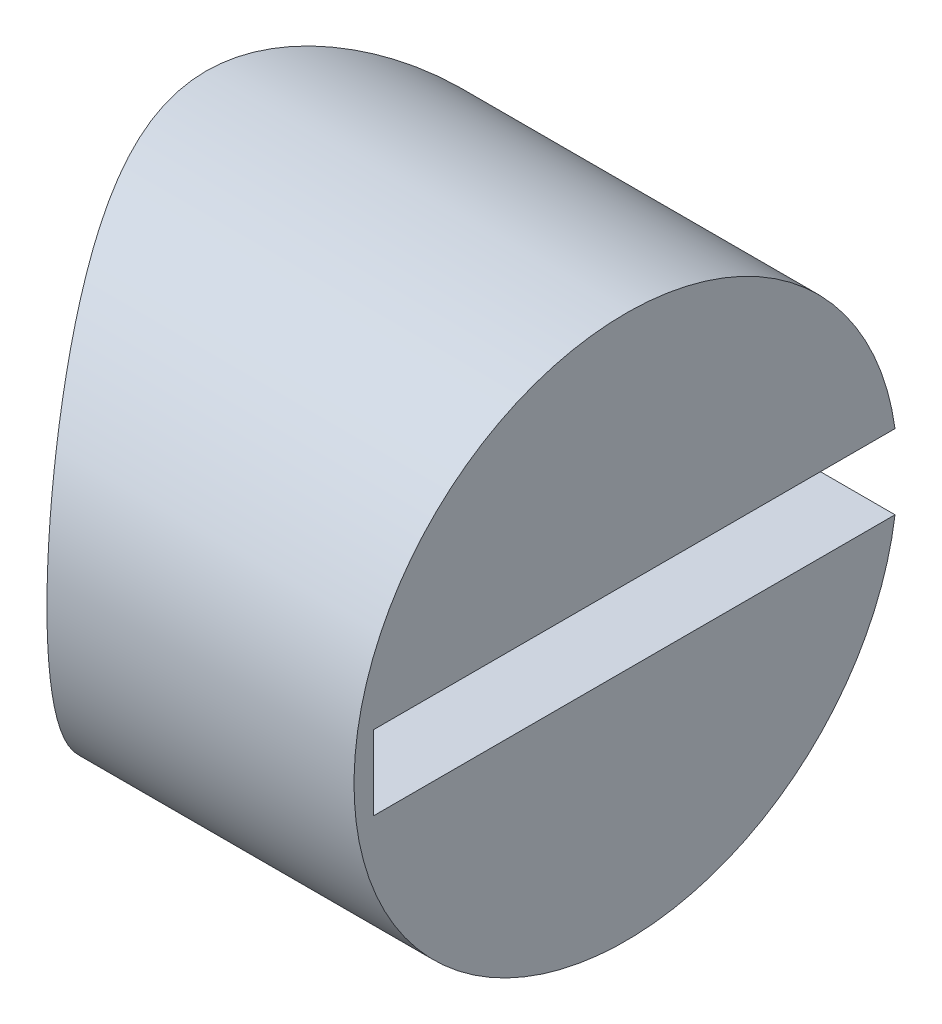
ISO-10303-21;
HEADER;
FILE_DESCRIPTION(('STEP AP214'),'2;1');
FILE_NAME('part.step','',(''),(''),'','','');
FILE_SCHEMA(('AUTOMOTIVE_DESIGN { 1 0 10303 214 1 1 1 1 }'));
ENDSEC;
DATA;
#1=APPLICATION_CONTEXT('core data for automotive mechanical design processes');
#2=APPLICATION_PROTOCOL_DEFINITION('international standard','automotive_design',2000,#1);
#3=PRODUCT_CONTEXT('',#1,'mechanical');
#4=PRODUCT('Part','Part','',(#3));
#5=PRODUCT_RELATED_PRODUCT_CATEGORY('part','',(#4));
#6=PRODUCT_DEFINITION_FORMATION('','',#4);
#7=PRODUCT_DEFINITION_CONTEXT('part definition',#1,'design');
#8=PRODUCT_DEFINITION('design','',#6,#7);
#9=PRODUCT_DEFINITION_SHAPE('','',#8);
#10=(LENGTH_UNIT() NAMED_UNIT(*) SI_UNIT(.MILLI.,.METRE.));
#11=(NAMED_UNIT(*) PLANE_ANGLE_UNIT() SI_UNIT($,.RADIAN.));
#12=(NAMED_UNIT(*) SI_UNIT($,.STERADIAN.) SOLID_ANGLE_UNIT());
#13=UNCERTAINTY_MEASURE_WITH_UNIT(LENGTH_MEASURE(1.E-05),#10,'distance_accuracy_value','');
#14=(GEOMETRIC_REPRESENTATION_CONTEXT(3) GLOBAL_UNCERTAINTY_ASSIGNED_CONTEXT((#13)) GLOBAL_UNIT_ASSIGNED_CONTEXT((#10,
#11,#12)) REPRESENTATION_CONTEXT('',''));
#15=CARTESIAN_POINT('',(0.,0.,0.));
#16=DIRECTION('',(0.,0.,1.));
#17=DIRECTION('',(1.,0.,0.));
#18=AXIS2_PLACEMENT_3D('',#15,#16,#17);
#19=CARTESIAN_POINT('',(18.1165376918575,6.,2.20308013006969));
#20=DIRECTION('',(0.,0.,-1.));
#21=DIRECTION('',(-1.,0.,0.));
#22=AXIS2_PLACEMENT_3D('',#19,#20,#21);
#23=PLANE('',#22);
#24=DIRECTION('',(-1.,0.,0.));
#25=VECTOR('',#24,1.);
#26=CARTESIAN_POINT('',(18.1165376918575,3.32583707335798,2.20308013006969));
#27=LINE('',#26,#25);
#28=CARTESIAN_POINT('',(18.,3.32583707335798,2.20308013006969));
#29=VERTEX_POINT('',#28);
#30=CARTESIAN_POINT('',(17.1165376918575,3.32583707335798,2.20308013006969));
#31=VERTEX_POINT('',#30);
#32=EDGE_CURVE('E94',#29,#31,#27,.T.);
#33=ORIENTED_EDGE('',*,*,#32,.F.);
#34=DIRECTION('',(0.,-1.,0.));
#35=VECTOR('',#34,1.);
#36=CARTESIAN_POINT('',(18.,6.,2.20308013006969));
#37=LINE('',#36,#35);
#38=CARTESIAN_POINT('',(18.,2.67416292664202,2.20308013006969));
#39=VERTEX_POINT('',#38);
#40=EDGE_CURVE('E89',#29,#39,#37,.T.);
#41=ORIENTED_EDGE('',*,*,#40,.T.);
#42=DIRECTION('',(-1.,0.,0.));
#43=VECTOR('',#42,1.);
#44=CARTESIAN_POINT('',(18.1165376918575,2.67416292664202,2.20308013006969));
#45=LINE('',#44,#43);
#46=CARTESIAN_POINT('',(17.1165376918575,2.67416292664202,2.20308013006969));
#47=VERTEX_POINT('',#46);
#48=EDGE_CURVE('E83',#39,#47,#45,.T.);
#49=ORIENTED_EDGE('',*,*,#48,.T.);
#50=DIRECTION('',(0.,-1.,0.));
#51=VECTOR('',#50,1.);
#52=CARTESIAN_POINT('',(17.1165376918575,6.,2.20308013006969));
#53=LINE('',#52,#51);
#54=EDGE_CURVE('E88',#31,#47,#53,.T.);
#55=ORIENTED_EDGE('',*,*,#54,.F.);
#56=EDGE_LOOP('',(#33,#41,#49,#55));
#57=FACE_BOUND('',#56,.T.);
#58=ADVANCED_FACE('F46',(#57),#23,.T.);
#59=CARTESIAN_POINT('',(18.1165376918575,3.32583707335798,2.20308013006969));
#60=DIRECTION('',(0.,-1.,0.));
#61=DIRECTION('',(0.,0.,-1.));
#62=AXIS2_PLACEMENT_3D('',#59,#60,#61);
#63=PLANE('',#62);
#64=DIRECTION('',(-1.,0.,0.));
#65=VECTOR('',#64,1.);
#66=CARTESIAN_POINT('',(18.25,3.32583707335798,-2.35254228476886));
#67=LINE('',#66,#65);
#68=CARTESIAN_POINT('',(18.,3.32583707335798,-2.35254228476886));
#69=VERTEX_POINT('',#68);
#70=CARTESIAN_POINT('',(17.097735902548,3.32583707335798,-2.35254228476886));
#71=VERTEX_POINT('',#70);
#72=EDGE_CURVE('E109',#69,#71,#67,.T.);
#73=ORIENTED_EDGE('',*,*,#72,.F.);
#74=DIRECTION('',(0.,0.,1.));
#75=VECTOR('',#74,1.);
#76=CARTESIAN_POINT('',(18.,3.32583707335798,2.20308013006969));
#77=LINE('',#76,#75);
#78=EDGE_CURVE('E62',#69,#29,#77,.T.);
#79=ORIENTED_EDGE('',*,*,#78,.T.);
#80=ORIENTED_EDGE('',*,*,#32,.T.);
#81=CARTESIAN_POINT('',(-1.,3.32583707335798,0.));
#82=DIRECTION('',(0.,-1.,0.));
#83=DIRECTION('',(0.,0.,-1.));
#84=AXIS2_PLACEMENT_3D('',#81,#82,#83);
#85=CIRCLE('',#84,18.25);
#86=EDGE_CURVE('E105',#71,#31,#85,.T.);
#87=ORIENTED_EDGE('',*,*,#86,.F.);
#88=EDGE_LOOP('',(#73,#79,#80,#87));
#89=FACE_BOUND('',#88,.T.);
#90=ADVANCED_FACE('F138',(#89),#63,.T.);
#91=CARTESIAN_POINT('',(17.850655436183,2.67416292664202,-3.79691986993031));
#92=DIRECTION('',(0.,1.,0.));
#93=DIRECTION('',(0.,0.,1.));
#94=AXIS2_PLACEMENT_3D('',#91,#92,#93);
#95=PLANE('',#94);
#96=ORIENTED_EDGE('',*,*,#48,.F.);
#97=DIRECTION('',(0.,0.,-1.));
#98=VECTOR('',#97,1.);
#99=CARTESIAN_POINT('',(18.,2.67416292664202,-3.79691986993031));
#100=LINE('',#99,#98);
#101=CARTESIAN_POINT('',(18.,2.67416292664202,-2.35254228476886));
#102=VERTEX_POINT('',#101);
#103=EDGE_CURVE('E139',#39,#102,#100,.T.);
#104=ORIENTED_EDGE('',*,*,#103,.T.);
#105=DIRECTION('',(-1.,0.,0.));
#106=VECTOR('',#105,1.);
#107=CARTESIAN_POINT('',(18.25,2.67416292664202,-2.35254228476886));
#108=LINE('',#107,#106);
#109=CARTESIAN_POINT('',(17.097735902548,2.67416292664202,-2.35254228476886));
#110=VERTEX_POINT('',#109);
#111=EDGE_CURVE('E54',#110,#102,#108,.F.);
#112=ORIENTED_EDGE('',*,*,#111,.F.);
#113=CARTESIAN_POINT('',(-1.,2.67416292664202,0.));
#114=DIRECTION('',(0.,1.,0.));
#115=DIRECTION('',(0.,0.,1.));
#116=AXIS2_PLACEMENT_3D('',#113,#114,#115);
#117=CIRCLE('',#116,18.25);
#118=EDGE_CURVE('E99',#47,#110,#117,.T.);
#119=ORIENTED_EDGE('',*,*,#118,.F.);
#120=EDGE_LOOP('',(#96,#104,#112,#119));
#121=FACE_BOUND('',#120,.T.);
#122=ADVANCED_FACE('F104',(#121),#95,.T.);
#123=CARTESIAN_POINT('',(18.25,3.,0.));
#124=DIRECTION('',(-1.,0.,0.));
#125=DIRECTION('',(0.,0.,1.));
#126=AXIS2_PLACEMENT_3D('',#123,#124,#125);
#127=CYLINDRICAL_SURFACE('',#126,2.375);
#128=CARTESIAN_POINT('',(14.5699347590451,0.864400915161115,1.03915442937648));
#129=CARTESIAN_POINT('',(14.532261280967,0.821085344243296,0.95014131885175));
#130=CARTESIAN_POINT('',(14.4965986971376,0.782941626493204,0.857638030698953));
#131=CARTESIAN_POINT('',(14.4330334419647,0.718024609399077,0.665908862075629));
#132=CARTESIAN_POINT('',(14.405138589969,0.691262753364969,0.566676331671528));
#133=CARTESIAN_POINT('',(14.372361181637,0.660643376592978,0.413289968436924));
#134=CARTESIAN_POINT('',(14.3629142047324,0.651999100970354,0.36104039159496));
#135=CARTESIAN_POINT('',(14.3476827550688,0.638192659761498,0.255568361032294));
#136=CARTESIAN_POINT('',(14.341896217254,0.633028530724701,0.202346473315096));
#137=CARTESIAN_POINT('',(14.334355629438,0.626317619150242,0.0954808057151526));
#138=CARTESIAN_POINT('',(14.3325943422839,0.624764344432173,0.0418379572831925));
#139=CARTESIAN_POINT('',(14.3331912257397,0.625294051890574,-0.0653913185596071));
#140=CARTESIAN_POINT('',(14.3355490470313,0.627376725722688,-0.118977750369214));
#141=CARTESIAN_POINT('',(14.3473597328304,0.637899688746503,-0.263538236915222));
#142=CARTESIAN_POINT('',(14.3606677735403,0.649809701870783,-0.353979563481457));
#143=CARTESIAN_POINT('',(14.3967721434786,0.683378868754725,-0.531103072367871));
#144=CARTESIAN_POINT('',(14.4195881921789,0.705058291777705,-0.617777026227758));
#145=CARTESIAN_POINT('',(14.4847140812114,0.770182037299633,-0.828243906078563));
#146=CARTESIAN_POINT('',(14.531076913591,0.819088478480586,-0.949081059044288));
#147=CARTESIAN_POINT('',(14.6301404916669,0.934415653046942,-1.17924528382042));
#148=CARTESIAN_POINT('',(14.6828530191417,1.00086922583023,-1.28855023064129));
#149=CARTESIAN_POINT('',(14.7904252853703,1.15251575436336,-1.49821612701064));
#150=CARTESIAN_POINT('',(14.845301189767,1.23822235240744,-1.59819843489821));
#151=CARTESIAN_POINT('',(14.9507962706194,1.42623324343095,-1.78361226490229));
#152=CARTESIAN_POINT('',(15.0014207729419,1.52851628507317,-1.86906213418636));
#153=CARTESIAN_POINT('',(15.0895451373331,1.73681034798782,-2.01478491107707));
#154=CARTESIAN_POINT('',(15.1278681536618,1.84126882001129,-2.07676870978046));
#155=CARTESIAN_POINT('',(15.1954290885343,2.06087065449729,-2.18486023116763));
#156=CARTESIAN_POINT('',(15.2246700296445,2.17601044555295,-2.23097323629552));
#157=CARTESIAN_POINT('',(15.2720132450649,2.41494767188962,-2.30522575948593));
#158=CARTESIAN_POINT('',(15.2900509618142,2.53879078982524,-2.33326114159592));
#159=CARTESIAN_POINT('',(15.3131755271682,2.7905430807739,-2.36915387307792));
#160=CARTESIAN_POINT('',(15.3182693911003,2.91845001319657,-2.37702215266437));
#161=CARTESIAN_POINT('',(15.3152442498206,3.16058144617906,-2.37233771224985));
#162=CARTESIAN_POINT('',(15.3084225925404,3.27486812179561,-2.36179014043319));
#163=CARTESIAN_POINT('',(15.2845077088614,3.49966881888721,-2.32463627291773));
#164=CARTESIAN_POINT('',(15.2674144942333,3.61018284468533,-2.29802999562117));
#165=CARTESIAN_POINT('',(15.2241231438048,3.82458908771562,-2.23009649266413));
#166=CARTESIAN_POINT('',(15.1979290574355,3.92848422573113,-2.18877581396996));
#167=CARTESIAN_POINT('',(15.1380422071007,4.12770567738207,-2.09311431622953));
#168=CARTESIAN_POINT('',(15.1043483125926,4.22303069608843,-2.03877153409934));
#169=CARTESIAN_POINT('',(15.0271724922604,4.4140649220293,-1.91197251040366));
#170=CARTESIAN_POINT('',(14.9830146114674,4.50859892598914,-1.83816296224651));
#171=CARTESIAN_POINT('',(14.8904599780247,4.68455700998357,-1.67840571080163));
#172=CARTESIAN_POINT('',(14.8420573107896,4.76596233395187,-1.59244096532103));
#173=CARTESIAN_POINT('',(14.7362906705802,4.92706705362857,-1.39493398498447));
#174=CARTESIAN_POINT('',(14.6787480731653,5.0043418955299,-1.2815052249655));
#175=CARTESIAN_POINT('',(14.5687662791743,5.13907964795686,-1.04111354648144));
#176=CARTESIAN_POINT('',(14.5163219223789,5.196562743879,-0.914164591229076));
#177=CARTESIAN_POINT('',(14.4408971610357,5.27414528673798,-0.691275158897109));
#178=CARTESIAN_POINT('',(14.4138958418073,5.30032223489973,-0.598833069611235));
#179=CARTESIAN_POINT('',(14.3702604106574,5.34147630652131,-0.409237609711479));
#180=CARTESIAN_POINT('',(14.3535983310642,5.35648366590218,-0.312097721705367));
#181=CARTESIAN_POINT('',(14.3336778455717,5.37433093697124,-0.114391943558449));
#182=CARTESIAN_POINT('',(14.3305361874119,5.37706487737038,-0.0138037430375299));
#183=CARTESIAN_POINT('',(14.3387230539154,5.36979994736584,0.186356277285663));
#184=CARTESIAN_POINT('',(14.350065592067,5.35978874604121,0.28592701869276));
#185=CARTESIAN_POINT('',(14.3871416554862,5.32572741529966,0.49421876150183));
#186=CARTESIAN_POINT('',(14.4146337332955,5.29994197770674,0.602324705488238));
#187=CARTESIAN_POINT('',(14.4796446682214,5.23483958043799,0.811272310513198));
#188=CARTESIAN_POINT('',(14.5171912206062,5.19548515727066,0.912092914838497));
#189=CARTESIAN_POINT('',(14.6111111111592,5.08902879519458,1.13895147379224));
#190=CARTESIAN_POINT('',(14.6695350176429,5.01704067904901,1.26184312789269));
#191=CARTESIAN_POINT('',(14.7872489669118,4.85272587202875,1.49268166441829));
#192=CARTESIAN_POINT('',(14.8465393987305,4.76038976642585,1.60062159111589));
#193=CARTESIAN_POINT('',(14.9604932273682,4.55558097492609,1.80038396670941));
#194=CARTESIAN_POINT('',(15.0151202456053,4.44296812559281,1.89208480539059));
#195=CARTESIAN_POINT('',(15.1140800272601,4.19981075734631,2.05484059887084));
#196=CARTESIAN_POINT('',(15.1584334397332,4.06930306149038,2.12593704028961));
#197=CARTESIAN_POINT('',(15.2235921545213,3.82688014043573,2.22932026495844));
#198=CARTESIAN_POINT('',(15.2474937205316,3.71800975595542,2.26682512112449));
#199=CARTESIAN_POINT('',(15.2852677929013,3.49434228765776,2.32585411384418));
#200=CARTESIAN_POINT('',(15.2991462832497,3.37954878400693,2.3473877857416));
#201=CARTESIAN_POINT('',(15.3158885097712,3.14692933538127,2.37334530116474));
#202=CARTESIAN_POINT('',(15.3187236083703,3.02909630285407,2.37772466052393));
#203=CARTESIAN_POINT('',(15.3130832334657,2.79434901941658,2.3689929891393));
#204=CARTESIAN_POINT('',(15.3046069435966,2.67743483543401,2.35588069598819));
#205=CARTESIAN_POINT('',(15.2775573191581,2.4527950183092,2.31381112171444));
#206=CARTESIAN_POINT('',(15.2594126481329,2.34488920361448,2.28552621054468));
#207=CARTESIAN_POINT('',(15.2144995892072,2.13573051339254,2.2149163850566));
#208=CARTESIAN_POINT('',(15.1877311934035,2.03447764396263,2.17259145787104));
#209=CARTESIAN_POINT('',(15.1250204811405,1.83369500856783,2.07215468966984));
#210=CARTESIAN_POINT('',(15.088569965701,1.7347738129558,2.01315026241354));
#211=CARTESIAN_POINT('',(15.0097375301293,1.54791349209847,1.88283636105121));
#212=CARTESIAN_POINT('',(14.9673478401894,1.45998904299349,1.81151073904543));
#213=CARTESIAN_POINT('',(14.8722994090132,1.28343717494588,1.64645526264228));
#214=CARTESIAN_POINT('',(14.8190629232269,1.19677123081275,1.55096699598771));
#215=CARTESIAN_POINT('',(14.7122741897271,1.04015041942618,1.34760876011951));
#216=CARTESIAN_POINT('',(14.6587229692518,0.97015701367264,1.23976821545575));
#217=CARTESIAN_POINT('',(14.595024333729,0.893559562018735,1.09753696540633));
#218=CARTESIAN_POINT('',(14.5823700004576,0.878698495548233,1.06853582909644));
#219=CARTESIAN_POINT('',(14.5699347590451,0.864400915161115,1.03915442937648));
#220=B_SPLINE_CURVE_WITH_KNOTS('',3,(#128,#129,#130,#131,#132,#133,#134,#135,#136,#137,#138,
#139,#140,#141,#142,#143,#144,#145,#146,#147,#148,#149,#150,#151,#152,#153,#154,#155,#156,#157,
#158,#159,#160,#161,#162,#163,#164,#165,#166,#167,#168,#169,#170,#171,#172,#173,#174,#175,#176,
#177,#178,#179,#180,#181,#182,#183,#184,#185,#186,#187,#188,#189,#190,#191,#192,#193,#194,#195,
#196,#197,#198,#199,#200,#201,#202,#203,#204,#205,#206,#207,#208,#209,#210,#211,#212,#213,#214,
#215,#216,#217,#218,#219),.UNSPECIFIED.,.T.,.F.,(4,2,2,2,2,2,2,2,2,2,2,2,2,2,2,2,2,2,2,2,2,2,2,
2,2,2,2,2,2,2,2,2,2,2,2,2,2,2,2,2,2,2,2,2,2,4),(0.,0.317700647175201,0.635719959404937,
0.796897388326552,0.957983806872616,1.11878037333245,1.27956330420177,1.55477158770575,
1.83055351252675,2.24336898972443,2.65696259390751,3.08328104057607,3.50905720010662,
3.88956502480313,4.26994607829812,4.65249918714582,5.03484491505967,5.37810871184472,
5.72137211527246,6.06448297890761,6.40764559912949,6.78960847899211,7.17211230018177,
7.61674216943987,8.06091721263246,8.35930523621549,8.65688256010371,8.95702434859868,
9.2574567449933,9.59904506218951,9.94158414663414,10.4011011127562,10.860831138984,
11.3238704089153,11.7859707742304,12.1372742249707,12.488367766316,12.8403711549312,
13.1923999497045,13.5299813401823,13.8675630400439,14.2286010683784,14.5901159060493,
15.0070913981902,15.4230934914489,15.5279599504561),.UNSPECIFIED.);
#221=CARTESIAN_POINT('',(14.5699347590451,0.864400915161115,1.03915442937648));
#222=VERTEX_POINT('',#221);
#223=EDGE_CURVE('E111',#222,#222,#220,.T.);
#224=ORIENTED_EDGE('',*,*,#223,.T.);
#225=EDGE_LOOP('',(#224));
#226=FACE_BOUND('',#225,.T.);
#227=CARTESIAN_POINT('',(18.,3.,0.));
#228=DIRECTION('',(1.,0.,0.));
#229=DIRECTION('',(0.,0.,-1.));
#230=AXIS2_PLACEMENT_3D('',#227,#228,#229);
#231=CIRCLE('',#230,2.375);
#232=EDGE_CURVE('E13',#69,#102,#231,.T.);
#233=ORIENTED_EDGE('',*,*,#232,.F.);
#234=ORIENTED_EDGE('',*,*,#72,.T.);
#235=CARTESIAN_POINT('',(17.097735902548,2.67416292664202,-2.35254228476886));
#236=CARTESIAN_POINT('',(17.0957802545376,2.78277528442801,-2.36751409492295));
#237=CARTESIAN_POINT('',(17.0948024305325,2.89138764221401,-2.375));
#238=CARTESIAN_POINT('',(17.0948024305325,3.10861235778599,-2.375));
#239=CARTESIAN_POINT('',(17.0957802545376,3.21722471557199,-2.36751409492295));
#240=CARTESIAN_POINT('',(17.097735902548,3.32583707335798,-2.35254228476886));
#241=B_SPLINE_CURVE_WITH_KNOTS('',3,(#235,#236,#237,#238,#239,#240),.UNSPECIFIED.,.F.,.F.,(4,2,
4),(0.,0.326623257907278,0.653246515814556),.UNSPECIFIED.);
#242=EDGE_CURVE('E69',#110,#71,#241,.T.);
#243=ORIENTED_EDGE('',*,*,#242,.F.);
#244=ORIENTED_EDGE('',*,*,#111,.T.);
#245=EDGE_LOOP('',(#233,#234,#243,#244));
#246=FACE_BOUND('',#245,.T.);
#247=ADVANCED_FACE('F119',(#226,#246),#127,.T.);
#248=CARTESIAN_POINT('',(-1.,6.,0.));
#249=DIRECTION('',(0.,-1.,0.));
#250=DIRECTION('',(0.,0.,-1.));
#251=AXIS2_PLACEMENT_3D('',#248,#249,#250);
#252=CYLINDRICAL_SURFACE('',#251,18.25);
#253=ORIENTED_EDGE('',*,*,#118,.T.);
#254=ORIENTED_EDGE('',*,*,#242,.T.);
#255=ORIENTED_EDGE('',*,*,#86,.T.);
#256=ORIENTED_EDGE('',*,*,#54,.T.);
#257=EDGE_LOOP('',(#253,#254,#255,#256));
#258=FACE_BOUND('',#257,.T.);
#259=ADVANCED_FACE('F100',(#258),#252,.T.);
#260=CARTESIAN_POINT('',(0.,3.,0.));
#261=DIRECTION('',(0.,-1.,0.));
#262=DIRECTION('',(0.,0.,-1.));
#263=AXIS2_PLACEMENT_3D('',#260,#261,#262);
#264=TOROIDAL_SURFACE('',#263,12.5,3.);
#265=ORIENTED_EDGE('',*,*,#223,.F.);
#266=EDGE_LOOP('',(#265));
#267=FACE_BOUND('',#266,.T.);
#268=ADVANCED_FACE('F48',(#267),#264,.F.);
#269=CARTESIAN_POINT('',(18.,0.,0.));
#270=DIRECTION('',(1.,0.,0.));
#271=DIRECTION('',(0.,0.,-1.));
#272=AXIS2_PLACEMENT_3D('',#269,#270,#271);
#273=PLANE('',#272);
#274=ORIENTED_EDGE('',*,*,#78,.F.);
#275=ORIENTED_EDGE('',*,*,#232,.T.);
#276=ORIENTED_EDGE('',*,*,#103,.F.);
#277=ORIENTED_EDGE('',*,*,#40,.F.);
#278=EDGE_LOOP('',(#274,#275,#276,#277));
#279=FACE_BOUND('',#278,.T.);
#280=ADVANCED_FACE('F142',(#279),#273,.T.);
#281=CLOSED_SHELL('',(#58,#90,#122,#247,#259,#268,#280));
#282=MANIFOLD_SOLID_BREP('B2',#281);
#283=ADVANCED_BREP_SHAPE_REPRESENTATION('',(#18,#282),#14);
#284=SHAPE_DEFINITION_REPRESENTATION(#9,#283);
ENDSEC;
END-ISO-10303-21;
